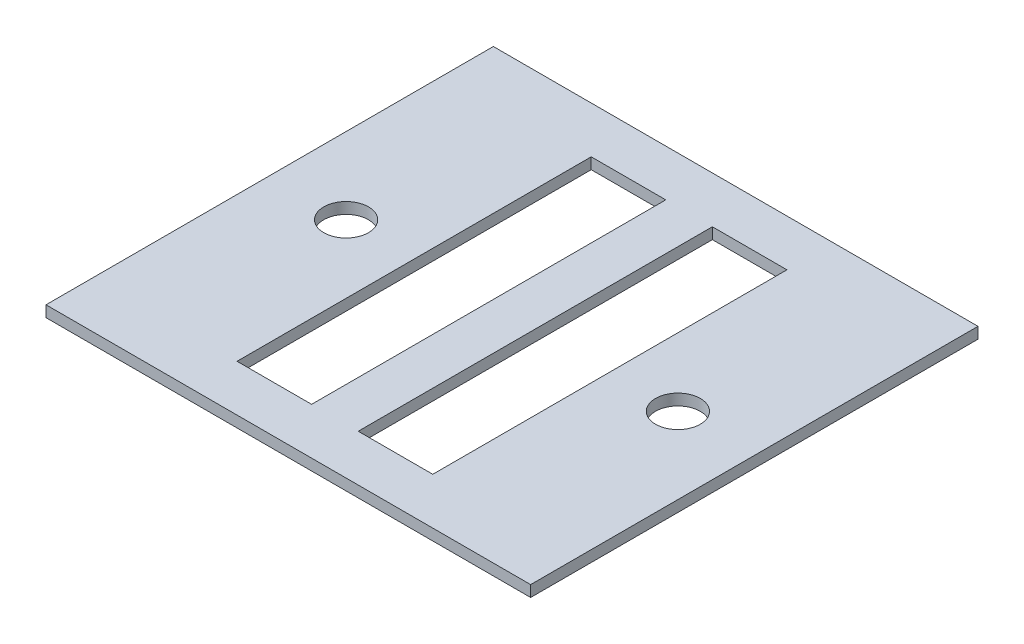
ISO-10303-21;
HEADER;
FILE_DESCRIPTION(('STEP AP214'),'2;1');
FILE_NAME('part.step','',(''),(''),'','','');
FILE_SCHEMA(('AUTOMOTIVE_DESIGN { 1 0 10303 214 1 1 1 1 }'));
ENDSEC;
DATA;
#1=APPLICATION_CONTEXT('core data for automotive mechanical design processes');
#2=APPLICATION_PROTOCOL_DEFINITION('international standard','automotive_design',2000,#1);
#3=PRODUCT_CONTEXT('',#1,'mechanical');
#4=PRODUCT('Part','Part','',(#3));
#5=PRODUCT_RELATED_PRODUCT_CATEGORY('part','',(#4));
#6=PRODUCT_DEFINITION_FORMATION('','',#4);
#7=PRODUCT_DEFINITION_CONTEXT('part definition',#1,'design');
#8=PRODUCT_DEFINITION('design','',#6,#7);
#9=PRODUCT_DEFINITION_SHAPE('','',#8);
#10=(LENGTH_UNIT() NAMED_UNIT(*) SI_UNIT(.MILLI.,.METRE.));
#11=(NAMED_UNIT(*) PLANE_ANGLE_UNIT() SI_UNIT($,.RADIAN.));
#12=(NAMED_UNIT(*) SI_UNIT($,.STERADIAN.) SOLID_ANGLE_UNIT());
#13=UNCERTAINTY_MEASURE_WITH_UNIT(LENGTH_MEASURE(1.E-05),#10,'distance_accuracy_value','');
#14=(GEOMETRIC_REPRESENTATION_CONTEXT(3) GLOBAL_UNCERTAINTY_ASSIGNED_CONTEXT((#13)) GLOBAL_UNIT_ASSIGNED_CONTEXT((#10,
#11,#12)) REPRESENTATION_CONTEXT('',''));
#15=CARTESIAN_POINT('',(0.,0.,0.));
#16=DIRECTION('',(0.,0.,1.));
#17=DIRECTION('',(1.,0.,0.));
#18=AXIS2_PLACEMENT_3D('',#15,#16,#17);
#19=CARTESIAN_POINT('',(0.,3.,0.));
#20=DIRECTION('',(0.,-1.,0.));
#21=DIRECTION('',(0.,0.,-1.));
#22=AXIS2_PLACEMENT_3D('',#19,#20,#21);
#23=PLANE('',#22);
#24=CARTESIAN_POINT('',(-44.5,3.,0.));
#25=DIRECTION('',(0.,-1.,0.));
#26=DIRECTION('',(0.,0.,-1.));
#27=AXIS2_PLACEMENT_3D('',#24,#25,#26);
#28=CIRCLE('',#27,6.);
#29=CARTESIAN_POINT('',(-44.5,3.,-6.));
#30=VERTEX_POINT('',#29);
#31=EDGE_CURVE('E313',#30,#30,#28,.F.);
#32=ORIENTED_EDGE('',*,*,#31,.F.);
#33=EDGE_LOOP('',(#32));
#34=FACE_BOUND('',#33,.T.);
#35=CARTESIAN_POINT('',(44.5,3.,0.));
#36=DIRECTION('',(0.,-1.,0.));
#37=DIRECTION('',(0.,0.,-1.));
#38=AXIS2_PLACEMENT_3D('',#35,#36,#37);
#39=CIRCLE('',#38,6.);
#40=CARTESIAN_POINT('',(44.5,3.,-6.));
#41=VERTEX_POINT('',#40);
#42=EDGE_CURVE('E138',#41,#41,#39,.T.);
#43=ORIENTED_EDGE('',*,*,#42,.T.);
#44=EDGE_LOOP('',(#43));
#45=FACE_BOUND('',#44,.T.);
#46=DIRECTION('',(0.,0.,-1.));
#47=VECTOR('',#46,1.);
#48=CARTESIAN_POINT('',(65.,3.,60.));
#49=LINE('',#48,#47);
#50=CARTESIAN_POINT('',(65.,3.,60.));
#51=VERTEX_POINT('',#50);
#52=CARTESIAN_POINT('',(65.,3.,-60.));
#53=VERTEX_POINT('',#52);
#54=EDGE_CURVE('E196',#51,#53,#49,.T.);
#55=ORIENTED_EDGE('',*,*,#54,.T.);
#56=DIRECTION('',(-1.,0.,0.));
#57=VECTOR('',#56,1.);
#58=CARTESIAN_POINT('',(-65.,3.,-60.));
#59=LINE('',#58,#57);
#60=CARTESIAN_POINT('',(-65.,3.,-60.));
#61=VERTEX_POINT('',#60);
#62=EDGE_CURVE('E199',#53,#61,#59,.T.);
#63=ORIENTED_EDGE('',*,*,#62,.T.);
#64=DIRECTION('',(0.,0.,1.));
#65=VECTOR('',#64,1.);
#66=CARTESIAN_POINT('',(-65.,3.,60.));
#67=LINE('',#66,#65);
#68=CARTESIAN_POINT('',(-65.,3.,60.));
#69=VERTEX_POINT('',#68);
#70=EDGE_CURVE('E202',#61,#69,#67,.T.);
#71=ORIENTED_EDGE('',*,*,#70,.T.);
#72=DIRECTION('',(1.,0.,0.));
#73=VECTOR('',#72,1.);
#74=CARTESIAN_POINT('',(-65.,3.,60.));
#75=LINE('',#74,#73);
#76=EDGE_CURVE('E204',#69,#51,#75,.T.);
#77=ORIENTED_EDGE('',*,*,#76,.T.);
#78=EDGE_LOOP('',(#55,#63,#71,#77));
#79=FACE_BOUND('',#78,.T.);
#80=DIRECTION('',(1.,0.,0.));
#81=VECTOR('',#80,1.);
#82=CARTESIAN_POINT('',(0.,3.,-47.5));
#83=LINE('',#82,#81);
#84=CARTESIAN_POINT('',(-26.25,3.,-47.5));
#85=VERTEX_POINT('',#84);
#86=CARTESIAN_POINT('',(-6.25,3.,-47.5));
#87=VERTEX_POINT('',#86);
#88=EDGE_CURVE('E176',#85,#87,#83,.T.);
#89=ORIENTED_EDGE('',*,*,#88,.T.);
#90=DIRECTION('',(0.,0.,1.));
#91=VECTOR('',#90,1.);
#92=CARTESIAN_POINT('',(-6.25,3.,0.));
#93=LINE('',#92,#91);
#94=CARTESIAN_POINT('',(-6.25,3.,47.5));
#95=VERTEX_POINT('',#94);
#96=EDGE_CURVE('E192',#87,#95,#93,.T.);
#97=ORIENTED_EDGE('',*,*,#96,.T.);
#98=DIRECTION('',(-1.,0.,0.));
#99=VECTOR('',#98,1.);
#100=CARTESIAN_POINT('',(0.,3.,47.5));
#101=LINE('',#100,#99);
#102=CARTESIAN_POINT('',(-26.25,3.,47.5));
#103=VERTEX_POINT('',#102);
#104=EDGE_CURVE('E189',#95,#103,#101,.T.);
#105=ORIENTED_EDGE('',*,*,#104,.T.);
#106=DIRECTION('',(0.,0.,-1.));
#107=VECTOR('',#106,1.);
#108=CARTESIAN_POINT('',(-26.25,3.,0.));
#109=LINE('',#108,#107);
#110=EDGE_CURVE('E186',#103,#85,#109,.T.);
#111=ORIENTED_EDGE('',*,*,#110,.T.);
#112=EDGE_LOOP('',(#89,#97,#105,#111));
#113=FACE_BOUND('',#112,.T.);
#114=DIRECTION('',(0.,0.,1.));
#115=VECTOR('',#114,1.);
#116=CARTESIAN_POINT('',(6.25,3.,0.));
#117=LINE('',#116,#115);
#118=CARTESIAN_POINT('',(6.25,3.,-47.5));
#119=VERTEX_POINT('',#118);
#120=CARTESIAN_POINT('',(6.25,3.,47.5));
#121=VERTEX_POINT('',#120);
#122=EDGE_CURVE('E132',#119,#121,#117,.T.);
#123=ORIENTED_EDGE('',*,*,#122,.F.);
#124=DIRECTION('',(-1.,0.,0.));
#125=VECTOR('',#124,1.);
#126=CARTESIAN_POINT('',(0.,3.,-47.5));
#127=LINE('',#126,#125);
#128=CARTESIAN_POINT('',(26.25,3.,-47.5));
#129=VERTEX_POINT('',#128);
#130=EDGE_CURVE('E157',#129,#119,#127,.T.);
#131=ORIENTED_EDGE('',*,*,#130,.F.);
#132=DIRECTION('',(0.,0.,-1.));
#133=VECTOR('',#132,1.);
#134=CARTESIAN_POINT('',(26.25,3.,0.));
#135=LINE('',#134,#133);
#136=CARTESIAN_POINT('',(26.25,3.,47.5));
#137=VERTEX_POINT('',#136);
#138=EDGE_CURVE('E155',#137,#129,#135,.T.);
#139=ORIENTED_EDGE('',*,*,#138,.F.);
#140=DIRECTION('',(1.,0.,0.));
#141=VECTOR('',#140,1.);
#142=CARTESIAN_POINT('',(0.,3.,47.5));
#143=LINE('',#142,#141);
#144=EDGE_CURVE('E149',#121,#137,#143,.T.);
#145=ORIENTED_EDGE('',*,*,#144,.F.);
#146=EDGE_LOOP('',(#123,#131,#139,#145));
#147=FACE_BOUND('',#146,.T.);
#148=ADVANCED_FACE('F33',(#34,#45,#79,#113,#147),#23,.F.);
#149=CARTESIAN_POINT('',(0.,0.,0.));
#150=DIRECTION('',(0.,-1.,0.));
#151=DIRECTION('',(0.,0.,-1.));
#152=AXIS2_PLACEMENT_3D('',#149,#150,#151);
#153=PLANE('',#152);
#154=CARTESIAN_POINT('',(-44.5,0.,0.));
#155=DIRECTION('',(0.,-1.,0.));
#156=DIRECTION('',(0.,0.,1.));
#157=AXIS2_PLACEMENT_3D('',#154,#155,#156);
#158=CIRCLE('',#157,6.);
#159=CARTESIAN_POINT('',(-44.5,0.,6.));
#160=VERTEX_POINT('',#159);
#161=EDGE_CURVE('E311',#160,#160,#158,.T.);
#162=ORIENTED_EDGE('',*,*,#161,.F.);
#163=EDGE_LOOP('',(#162));
#164=FACE_BOUND('',#163,.T.);
#165=CARTESIAN_POINT('',(44.5,0.,0.));
#166=DIRECTION('',(0.,1.,0.));
#167=DIRECTION('',(0.,0.,1.));
#168=AXIS2_PLACEMENT_3D('',#165,#166,#167);
#169=CIRCLE('',#168,6.);
#170=CARTESIAN_POINT('',(44.5,0.,6.));
#171=VERTEX_POINT('',#170);
#172=EDGE_CURVE('E141',#171,#171,#169,.T.);
#173=ORIENTED_EDGE('',*,*,#172,.T.);
#174=EDGE_LOOP('',(#173));
#175=FACE_BOUND('',#174,.T.);
#176=DIRECTION('',(0.,0.,-1.));
#177=VECTOR('',#176,1.);
#178=CARTESIAN_POINT('',(-6.25,0.,47.5));
#179=LINE('',#178,#177);
#180=CARTESIAN_POINT('',(-6.25,0.,47.5));
#181=VERTEX_POINT('',#180);
#182=CARTESIAN_POINT('',(-6.25,0.,-47.5));
#183=VERTEX_POINT('',#182);
#184=EDGE_CURVE('E160',#181,#183,#179,.T.);
#185=ORIENTED_EDGE('',*,*,#184,.T.);
#186=DIRECTION('',(-1.,0.,0.));
#187=VECTOR('',#186,1.);
#188=CARTESIAN_POINT('',(-26.25,0.,-47.5));
#189=LINE('',#188,#187);
#190=CARTESIAN_POINT('',(-26.25,0.,-47.5));
#191=VERTEX_POINT('',#190);
#192=EDGE_CURVE('E163',#183,#191,#189,.T.);
#193=ORIENTED_EDGE('',*,*,#192,.T.);
#194=DIRECTION('',(0.,0.,1.));
#195=VECTOR('',#194,1.);
#196=CARTESIAN_POINT('',(-26.25,0.,47.5));
#197=LINE('',#196,#195);
#198=CARTESIAN_POINT('',(-26.25,0.,47.5));
#199=VERTEX_POINT('',#198);
#200=EDGE_CURVE('E166',#191,#199,#197,.T.);
#201=ORIENTED_EDGE('',*,*,#200,.T.);
#202=DIRECTION('',(1.,0.,0.));
#203=VECTOR('',#202,1.);
#204=CARTESIAN_POINT('',(-26.25,0.,47.5));
#205=LINE('',#204,#203);
#206=EDGE_CURVE('E169',#199,#181,#205,.T.);
#207=ORIENTED_EDGE('',*,*,#206,.T.);
#208=EDGE_LOOP('',(#185,#193,#201,#207));
#209=FACE_BOUND('',#208,.T.);
#210=DIRECTION('',(0.,0.,-1.));
#211=VECTOR('',#210,1.);
#212=CARTESIAN_POINT('',(65.,0.,60.));
#213=LINE('',#212,#211);
#214=CARTESIAN_POINT('',(65.,0.,60.));
#215=VERTEX_POINT('',#214);
#216=CARTESIAN_POINT('',(65.,0.,-60.));
#217=VERTEX_POINT('',#216);
#218=EDGE_CURVE('E195',#215,#217,#213,.T.);
#219=ORIENTED_EDGE('',*,*,#218,.F.);
#220=DIRECTION('',(1.,0.,0.));
#221=VECTOR('',#220,1.);
#222=CARTESIAN_POINT('',(-65.,0.,60.));
#223=LINE('',#222,#221);
#224=CARTESIAN_POINT('',(-65.,0.,60.));
#225=VERTEX_POINT('',#224);
#226=EDGE_CURVE('E200',#225,#215,#223,.T.);
#227=ORIENTED_EDGE('',*,*,#226,.F.);
#228=DIRECTION('',(0.,0.,1.));
#229=VECTOR('',#228,1.);
#230=CARTESIAN_POINT('',(-65.,0.,60.));
#231=LINE('',#230,#229);
#232=CARTESIAN_POINT('',(-65.,0.,-60.));
#233=VERTEX_POINT('',#232);
#234=EDGE_CURVE('E211',#233,#225,#231,.T.);
#235=ORIENTED_EDGE('',*,*,#234,.F.);
#236=DIRECTION('',(-1.,0.,0.));
#237=VECTOR('',#236,1.);
#238=CARTESIAN_POINT('',(-65.,0.,-60.));
#239=LINE('',#238,#237);
#240=EDGE_CURVE('E209',#217,#233,#239,.T.);
#241=ORIENTED_EDGE('',*,*,#240,.F.);
#242=EDGE_LOOP('',(#219,#227,#235,#241));
#243=FACE_BOUND('',#242,.T.);
#244=DIRECTION('',(1.,0.,0.));
#245=VECTOR('',#244,1.);
#246=CARTESIAN_POINT('',(26.25,0.,-47.5));
#247=LINE('',#246,#245);
#248=CARTESIAN_POINT('',(6.25,0.,-47.5));
#249=VERTEX_POINT('',#248);
#250=CARTESIAN_POINT('',(26.25,0.,-47.5));
#251=VERTEX_POINT('',#250);
#252=EDGE_CURVE('E134',#249,#251,#247,.T.);
#253=ORIENTED_EDGE('',*,*,#252,.F.);
#254=DIRECTION('',(0.,0.,-1.));
#255=VECTOR('',#254,1.);
#256=CARTESIAN_POINT('',(6.25,0.,47.5));
#257=LINE('',#256,#255);
#258=CARTESIAN_POINT('',(6.25,0.,47.5));
#259=VERTEX_POINT('',#258);
#260=EDGE_CURVE('E125',#259,#249,#257,.T.);
#261=ORIENTED_EDGE('',*,*,#260,.F.);
#262=DIRECTION('',(-1.,0.,0.));
#263=VECTOR('',#262,1.);
#264=CARTESIAN_POINT('',(26.25,0.,47.5));
#265=LINE('',#264,#263);
#266=CARTESIAN_POINT('',(26.25,0.,47.5));
#267=VERTEX_POINT('',#266);
#268=EDGE_CURVE('E119',#267,#259,#265,.T.);
#269=ORIENTED_EDGE('',*,*,#268,.F.);
#270=DIRECTION('',(0.,0.,1.));
#271=VECTOR('',#270,1.);
#272=CARTESIAN_POINT('',(26.25,0.,47.5));
#273=LINE('',#272,#271);
#274=EDGE_CURVE('E124',#251,#267,#273,.T.);
#275=ORIENTED_EDGE('',*,*,#274,.F.);
#276=EDGE_LOOP('',(#253,#261,#269,#275));
#277=FACE_BOUND('',#276,.T.);
#278=ADVANCED_FACE('F137',(#164,#175,#209,#243,#277),#153,.T.);
#279=CARTESIAN_POINT('',(65.,3.,60.));
#280=DIRECTION('',(-1.,0.,0.));
#281=DIRECTION('',(0.,0.,1.));
#282=AXIS2_PLACEMENT_3D('',#279,#280,#281);
#283=PLANE('',#282);
#284=ORIENTED_EDGE('',*,*,#218,.T.);
#285=DIRECTION('',(0.,-1.,0.));
#286=VECTOR('',#285,1.);
#287=CARTESIAN_POINT('',(65.,3.,-60.));
#288=LINE('',#287,#286);
#289=EDGE_CURVE('E11',#53,#217,#288,.T.);
#290=ORIENTED_EDGE('',*,*,#289,.F.);
#291=ORIENTED_EDGE('',*,*,#54,.F.);
#292=DIRECTION('',(0.,-1.,0.));
#293=VECTOR('',#292,1.);
#294=CARTESIAN_POINT('',(65.,3.,60.));
#295=LINE('',#294,#293);
#296=EDGE_CURVE('E206',#51,#215,#295,.T.);
#297=ORIENTED_EDGE('',*,*,#296,.T.);
#298=EDGE_LOOP('',(#284,#290,#291,#297));
#299=FACE_BOUND('',#298,.T.);
#300=ADVANCED_FACE('F35',(#299),#283,.F.);
#301=CARTESIAN_POINT('',(-65.,3.,-60.));
#302=DIRECTION('',(0.,0.,1.));
#303=DIRECTION('',(1.,0.,0.));
#304=AXIS2_PLACEMENT_3D('',#301,#302,#303);
#305=PLANE('',#304);
#306=ORIENTED_EDGE('',*,*,#240,.T.);
#307=DIRECTION('',(0.,-1.,0.));
#308=VECTOR('',#307,1.);
#309=CARTESIAN_POINT('',(-65.,3.,-60.));
#310=LINE('',#309,#308);
#311=EDGE_CURVE('E41',#61,#233,#310,.T.);
#312=ORIENTED_EDGE('',*,*,#311,.F.);
#313=ORIENTED_EDGE('',*,*,#62,.F.);
#314=ORIENTED_EDGE('',*,*,#289,.T.);
#315=EDGE_LOOP('',(#306,#312,#313,#314));
#316=FACE_BOUND('',#315,.T.);
#317=ADVANCED_FACE('F238',(#316),#305,.F.);
#318=CARTESIAN_POINT('',(-65.,3.,60.));
#319=DIRECTION('',(1.,0.,0.));
#320=DIRECTION('',(0.,0.,-1.));
#321=AXIS2_PLACEMENT_3D('',#318,#319,#320);
#322=PLANE('',#321);
#323=ORIENTED_EDGE('',*,*,#234,.T.);
#324=DIRECTION('',(0.,-1.,0.));
#325=VECTOR('',#324,1.);
#326=CARTESIAN_POINT('',(-65.,3.,60.));
#327=LINE('',#326,#325);
#328=EDGE_CURVE('E216',#69,#225,#327,.T.);
#329=ORIENTED_EDGE('',*,*,#328,.F.);
#330=ORIENTED_EDGE('',*,*,#70,.F.);
#331=ORIENTED_EDGE('',*,*,#311,.T.);
#332=EDGE_LOOP('',(#323,#329,#330,#331));
#333=FACE_BOUND('',#332,.T.);
#334=ADVANCED_FACE('F223',(#333),#322,.F.);
#335=CARTESIAN_POINT('',(-65.,3.,60.));
#336=DIRECTION('',(0.,0.,-1.));
#337=DIRECTION('',(-1.,0.,0.));
#338=AXIS2_PLACEMENT_3D('',#335,#336,#337);
#339=PLANE('',#338);
#340=ORIENTED_EDGE('',*,*,#226,.T.);
#341=ORIENTED_EDGE('',*,*,#296,.F.);
#342=ORIENTED_EDGE('',*,*,#76,.F.);
#343=ORIENTED_EDGE('',*,*,#328,.T.);
#344=EDGE_LOOP('',(#340,#341,#342,#343));
#345=FACE_BOUND('',#344,.T.);
#346=ADVANCED_FACE('F231',(#345),#339,.F.);
#347=CARTESIAN_POINT('',(-6.25,0.,47.5));
#348=DIRECTION('',(1.,0.,0.));
#349=DIRECTION('',(0.,0.,-1.));
#350=AXIS2_PLACEMENT_3D('',#347,#348,#349);
#351=PLANE('',#350);
#352=DIRECTION('',(0.,1.,0.));
#353=VECTOR('',#352,1.);
#354=CARTESIAN_POINT('',(-6.25,0.,-47.5));
#355=LINE('',#354,#353);
#356=EDGE_CURVE('E172',#183,#87,#355,.T.);
#357=ORIENTED_EDGE('',*,*,#356,.F.);
#358=ORIENTED_EDGE('',*,*,#184,.F.);
#359=DIRECTION('',(0.,1.,0.));
#360=VECTOR('',#359,1.);
#361=CARTESIAN_POINT('',(-6.25,0.,47.5));
#362=LINE('',#361,#360);
#363=EDGE_CURVE('E173',#181,#95,#362,.T.);
#364=ORIENTED_EDGE('',*,*,#363,.T.);
#365=ORIENTED_EDGE('',*,*,#96,.F.);
#366=EDGE_LOOP('',(#357,#358,#364,#365));
#367=FACE_BOUND('',#366,.T.);
#368=ADVANCED_FACE('F256',(#367),#351,.F.);
#369=CARTESIAN_POINT('',(-26.25,0.,47.5));
#370=DIRECTION('',(0.,0.,1.));
#371=DIRECTION('',(1.,0.,0.));
#372=AXIS2_PLACEMENT_3D('',#369,#370,#371);
#373=PLANE('',#372);
#374=ORIENTED_EDGE('',*,*,#363,.F.);
#375=ORIENTED_EDGE('',*,*,#206,.F.);
#376=DIRECTION('',(0.,1.,0.));
#377=VECTOR('',#376,1.);
#378=CARTESIAN_POINT('',(-26.25,0.,47.5));
#379=LINE('',#378,#377);
#380=EDGE_CURVE('E177',#199,#103,#379,.T.);
#381=ORIENTED_EDGE('',*,*,#380,.T.);
#382=ORIENTED_EDGE('',*,*,#104,.F.);
#383=EDGE_LOOP('',(#374,#375,#381,#382));
#384=FACE_BOUND('',#383,.T.);
#385=ADVANCED_FACE('F263',(#384),#373,.F.);
#386=CARTESIAN_POINT('',(-26.25,0.,47.5));
#387=DIRECTION('',(-1.,0.,0.));
#388=DIRECTION('',(0.,0.,1.));
#389=AXIS2_PLACEMENT_3D('',#386,#387,#388);
#390=PLANE('',#389);
#391=ORIENTED_EDGE('',*,*,#380,.F.);
#392=ORIENTED_EDGE('',*,*,#200,.F.);
#393=DIRECTION('',(0.,1.,0.));
#394=VECTOR('',#393,1.);
#395=CARTESIAN_POINT('',(-26.25,0.,-47.5));
#396=LINE('',#395,#394);
#397=EDGE_CURVE('E180',#191,#85,#396,.T.);
#398=ORIENTED_EDGE('',*,*,#397,.T.);
#399=ORIENTED_EDGE('',*,*,#110,.F.);
#400=EDGE_LOOP('',(#391,#392,#398,#399));
#401=FACE_BOUND('',#400,.T.);
#402=ADVANCED_FACE('F268',(#401),#390,.F.);
#403=CARTESIAN_POINT('',(-26.25,0.,-47.5));
#404=DIRECTION('',(0.,0.,-1.));
#405=DIRECTION('',(-1.,0.,0.));
#406=AXIS2_PLACEMENT_3D('',#403,#404,#405);
#407=PLANE('',#406);
#408=ORIENTED_EDGE('',*,*,#397,.F.);
#409=ORIENTED_EDGE('',*,*,#192,.F.);
#410=ORIENTED_EDGE('',*,*,#356,.T.);
#411=ORIENTED_EDGE('',*,*,#88,.F.);
#412=EDGE_LOOP('',(#408,#409,#410,#411));
#413=FACE_BOUND('',#412,.T.);
#414=ADVANCED_FACE('F276',(#413),#407,.F.);
#415=CARTESIAN_POINT('',(6.25,0.,47.5));
#416=DIRECTION('',(1.,0.,0.));
#417=DIRECTION('',(0.,0.,-1.));
#418=AXIS2_PLACEMENT_3D('',#415,#416,#417);
#419=PLANE('',#418);
#420=ORIENTED_EDGE('',*,*,#122,.T.);
#421=DIRECTION('',(0.,1.,0.));
#422=VECTOR('',#421,1.);
#423=CARTESIAN_POINT('',(6.25,0.,47.5));
#424=LINE('',#423,#422);
#425=EDGE_CURVE('E48',#259,#121,#424,.T.);
#426=ORIENTED_EDGE('',*,*,#425,.F.);
#427=ORIENTED_EDGE('',*,*,#260,.T.);
#428=DIRECTION('',(0.,1.,0.));
#429=VECTOR('',#428,1.);
#430=CARTESIAN_POINT('',(6.25,0.,-47.5));
#431=LINE('',#430,#429);
#432=EDGE_CURVE('E147',#249,#119,#431,.T.);
#433=ORIENTED_EDGE('',*,*,#432,.T.);
#434=EDGE_LOOP('',(#420,#426,#427,#433));
#435=FACE_BOUND('',#434,.T.);
#436=ADVANCED_FACE('F128',(#435),#419,.T.);
#437=CARTESIAN_POINT('',(26.25,0.,-47.5));
#438=DIRECTION('',(0.,0.,1.));
#439=DIRECTION('',(1.,0.,0.));
#440=AXIS2_PLACEMENT_3D('',#437,#438,#439);
#441=PLANE('',#440);
#442=ORIENTED_EDGE('',*,*,#130,.T.);
#443=ORIENTED_EDGE('',*,*,#432,.F.);
#444=ORIENTED_EDGE('',*,*,#252,.T.);
#445=DIRECTION('',(0.,1.,0.));
#446=VECTOR('',#445,1.);
#447=CARTESIAN_POINT('',(26.25,0.,-47.5));
#448=LINE('',#447,#446);
#449=EDGE_CURVE('E150',#251,#129,#448,.T.);
#450=ORIENTED_EDGE('',*,*,#449,.T.);
#451=EDGE_LOOP('',(#442,#443,#444,#450));
#452=FACE_BOUND('',#451,.T.);
#453=ADVANCED_FACE('F289',(#452),#441,.T.);
#454=CARTESIAN_POINT('',(26.25,0.,47.5));
#455=DIRECTION('',(-1.,0.,0.));
#456=DIRECTION('',(0.,0.,1.));
#457=AXIS2_PLACEMENT_3D('',#454,#455,#456);
#458=PLANE('',#457);
#459=ORIENTED_EDGE('',*,*,#138,.T.);
#460=ORIENTED_EDGE('',*,*,#449,.F.);
#461=ORIENTED_EDGE('',*,*,#274,.T.);
#462=DIRECTION('',(0.,1.,0.));
#463=VECTOR('',#462,1.);
#464=CARTESIAN_POINT('',(26.25,0.,47.5));
#465=LINE('',#464,#463);
#466=EDGE_CURVE('E53',#267,#137,#465,.T.);
#467=ORIENTED_EDGE('',*,*,#466,.T.);
#468=EDGE_LOOP('',(#459,#460,#461,#467));
#469=FACE_BOUND('',#468,.T.);
#470=ADVANCED_FACE('F293',(#469),#458,.T.);
#471=CARTESIAN_POINT('',(26.25,0.,47.5));
#472=DIRECTION('',(0.,0.,-1.));
#473=DIRECTION('',(-1.,0.,0.));
#474=AXIS2_PLACEMENT_3D('',#471,#472,#473);
#475=PLANE('',#474);
#476=ORIENTED_EDGE('',*,*,#144,.T.);
#477=ORIENTED_EDGE('',*,*,#466,.F.);
#478=ORIENTED_EDGE('',*,*,#268,.T.);
#479=ORIENTED_EDGE('',*,*,#425,.T.);
#480=EDGE_LOOP('',(#476,#477,#478,#479));
#481=FACE_BOUND('',#480,.T.);
#482=ADVANCED_FACE('F120',(#481),#475,.T.);
#483=CARTESIAN_POINT('',(44.5,0.,0.));
#484=DIRECTION('',(0.,1.,0.));
#485=DIRECTION('',(0.,0.,1.));
#486=AXIS2_PLACEMENT_3D('',#483,#484,#485);
#487=CYLINDRICAL_SURFACE('',#486,6.);
#488=ORIENTED_EDGE('',*,*,#172,.F.);
#489=EDGE_LOOP('',(#488));
#490=FACE_BOUND('',#489,.T.);
#491=ORIENTED_EDGE('',*,*,#42,.F.);
#492=EDGE_LOOP('',(#491));
#493=FACE_BOUND('',#492,.T.);
#494=ADVANCED_FACE('F292',(#490,#493),#487,.F.);
#495=CARTESIAN_POINT('',(-44.5,0.,0.));
#496=DIRECTION('',(0.,1.,0.));
#497=DIRECTION('',(0.,0.,1.));
#498=AXIS2_PLACEMENT_3D('',#495,#496,#497);
#499=CYLINDRICAL_SURFACE('',#498,6.);
#500=ORIENTED_EDGE('',*,*,#161,.T.);
#501=EDGE_LOOP('',(#500));
#502=FACE_BOUND('',#501,.T.);
#503=ORIENTED_EDGE('',*,*,#31,.T.);
#504=EDGE_LOOP('',(#503));
#505=FACE_BOUND('',#504,.T.);
#506=ADVANCED_FACE('F302',(#502,#505),#499,.F.);
#507=CLOSED_SHELL('',(#148,#278,#300,#317,#334,#346,#368,#385,#402,#414,#436,#453,#470,#482,
#494,#506));
#508=MANIFOLD_SOLID_BREP('B2',#507);
#509=ADVANCED_BREP_SHAPE_REPRESENTATION('',(#18,#508),#14);
#510=SHAPE_DEFINITION_REPRESENTATION(#9,#509);
ENDSEC;
END-ISO-10303-21;
